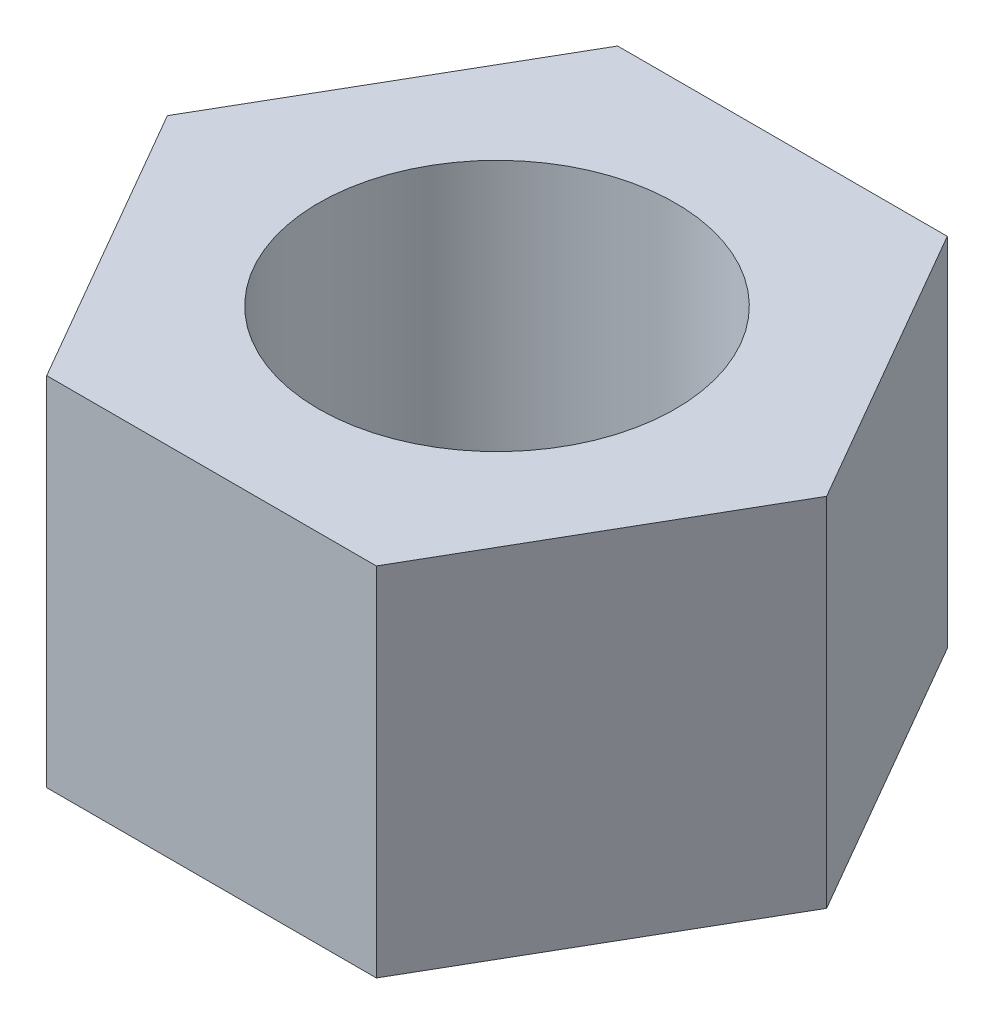
ISO-10303-21;
HEADER;
FILE_DESCRIPTION(('STEP AP214'),'2;1');
FILE_NAME('part.step','',(''),(''),'','','');
FILE_SCHEMA(('AUTOMOTIVE_DESIGN { 1 0 10303 214 1 1 1 1 }'));
ENDSEC;
DATA;
#1=APPLICATION_CONTEXT('core data for automotive mechanical design processes');
#2=APPLICATION_PROTOCOL_DEFINITION('international standard','automotive_design',2000,#1);
#3=PRODUCT_CONTEXT('',#1,'mechanical');
#4=PRODUCT('Part','Part','',(#3));
#5=PRODUCT_RELATED_PRODUCT_CATEGORY('part','',(#4));
#6=PRODUCT_DEFINITION_FORMATION('','',#4);
#7=PRODUCT_DEFINITION_CONTEXT('part definition',#1,'design');
#8=PRODUCT_DEFINITION('design','',#6,#7);
#9=PRODUCT_DEFINITION_SHAPE('','',#8);
#10=(LENGTH_UNIT() NAMED_UNIT(*) SI_UNIT(.MILLI.,.METRE.));
#11=(NAMED_UNIT(*) PLANE_ANGLE_UNIT() SI_UNIT($,.RADIAN.));
#12=(NAMED_UNIT(*) SI_UNIT($,.STERADIAN.) SOLID_ANGLE_UNIT());
#13=UNCERTAINTY_MEASURE_WITH_UNIT(LENGTH_MEASURE(1.E-05),#10,'distance_accuracy_value','');
#14=(GEOMETRIC_REPRESENTATION_CONTEXT(3) GLOBAL_UNCERTAINTY_ASSIGNED_CONTEXT((#13)) GLOBAL_UNIT_ASSIGNED_CONTEXT((#10,
#11,#12)) REPRESENTATION_CONTEXT('',''));
#15=CARTESIAN_POINT('',(0.,0.,0.));
#16=DIRECTION('',(0.,0.,1.));
#17=DIRECTION('',(1.,0.,0.));
#18=AXIS2_PLACEMENT_3D('',#15,#16,#17);
#19=CARTESIAN_POINT('',(2.3094010767585,5.,3.99999999999999));
#20=DIRECTION('',(-0.866025403784439,0.,-0.5));
#21=DIRECTION('',(-0.5,0.,0.866025403784439));
#22=AXIS2_PLACEMENT_3D('',#19,#20,#21);
#23=PLANE('',#22);
#24=DIRECTION('',(0.5,0.,-0.866025403784439));
#25=VECTOR('',#24,1.);
#26=CARTESIAN_POINT('',(2.3094010767585,0.,3.99999999999999));
#27=LINE('',#26,#25);
#28=CARTESIAN_POINT('',(2.3094010767585,0.,3.99999999999999));
#29=VERTEX_POINT('',#28);
#30=CARTESIAN_POINT('',(4.618802153517,0.,0.));
#31=VERTEX_POINT('',#30);
#32=EDGE_CURVE('E118',#29,#31,#27,.T.);
#33=ORIENTED_EDGE('',*,*,#32,.T.);
#34=DIRECTION('',(0.,-1.,0.));
#35=VECTOR('',#34,1.);
#36=CARTESIAN_POINT('',(4.618802153517,5.,0.));
#37=LINE('',#36,#35);
#38=CARTESIAN_POINT('',(4.618802153517,5.,0.));
#39=VERTEX_POINT('',#38);
#40=EDGE_CURVE('E11',#39,#31,#37,.T.);
#41=ORIENTED_EDGE('',*,*,#40,.F.);
#42=DIRECTION('',(0.5,0.,-0.866025403784439));
#43=VECTOR('',#42,1.);
#44=CARTESIAN_POINT('',(2.3094010767585,5.,3.99999999999999));
#45=LINE('',#44,#43);
#46=CARTESIAN_POINT('',(2.3094010767585,5.,3.99999999999999));
#47=VERTEX_POINT('',#46);
#48=EDGE_CURVE('E129',#47,#39,#45,.T.);
#49=ORIENTED_EDGE('',*,*,#48,.F.);
#50=DIRECTION('',(0.,-1.,0.));
#51=VECTOR('',#50,1.);
#52=CARTESIAN_POINT('',(2.3094010767585,5.,3.99999999999999));
#53=LINE('',#52,#51);
#54=EDGE_CURVE('E114',#47,#29,#53,.T.);
#55=ORIENTED_EDGE('',*,*,#54,.T.);
#56=EDGE_LOOP('',(#33,#41,#49,#55));
#57=FACE_BOUND('',#56,.T.);
#58=ADVANCED_FACE('F34',(#57),#23,.F.);
#59=CARTESIAN_POINT('',(4.618802153517,5.,0.));
#60=DIRECTION('',(-0.866025403784438,0.,0.5));
#61=DIRECTION('',(0.500000000000001,0.,0.866025403784438));
#62=AXIS2_PLACEMENT_3D('',#59,#60,#61);
#63=PLANE('',#62);
#64=DIRECTION('',(-0.5,0.,-0.866025403784438));
#65=VECTOR('',#64,1.);
#66=CARTESIAN_POINT('',(4.618802153517,0.,0.));
#67=LINE('',#66,#65);
#68=CARTESIAN_POINT('',(2.30940107675849,0.,-4.));
#69=VERTEX_POINT('',#68);
#70=EDGE_CURVE('E121',#31,#69,#67,.T.);
#71=ORIENTED_EDGE('',*,*,#70,.T.);
#72=DIRECTION('',(0.,-1.,0.));
#73=VECTOR('',#72,1.);
#74=CARTESIAN_POINT('',(2.30940107675849,5.,-4.));
#75=LINE('',#74,#73);
#76=CARTESIAN_POINT('',(2.30940107675849,5.,-4.));
#77=VERTEX_POINT('',#76);
#78=EDGE_CURVE('E42',#77,#69,#75,.T.);
#79=ORIENTED_EDGE('',*,*,#78,.F.);
#80=DIRECTION('',(-0.5,0.,-0.866025403784438));
#81=VECTOR('',#80,1.);
#82=CARTESIAN_POINT('',(4.618802153517,5.,0.));
#83=LINE('',#82,#81);
#84=EDGE_CURVE('E87',#39,#77,#83,.T.);
#85=ORIENTED_EDGE('',*,*,#84,.F.);
#86=ORIENTED_EDGE('',*,*,#40,.T.);
#87=EDGE_LOOP('',(#71,#79,#85,#86));
#88=FACE_BOUND('',#87,.T.);
#89=ADVANCED_FACE('F154',(#88),#63,.F.);
#90=CARTESIAN_POINT('',(2.30940107675849,5.,-4.));
#91=DIRECTION('',(0.,0.,1.));
#92=DIRECTION('',(1.,0.,0.));
#93=AXIS2_PLACEMENT_3D('',#90,#91,#92);
#94=PLANE('',#93);
#95=DIRECTION('',(-1.,0.,0.));
#96=VECTOR('',#95,1.);
#97=CARTESIAN_POINT('',(2.30940107675849,0.,-4.));
#98=LINE('',#97,#96);
#99=CARTESIAN_POINT('',(-2.30940107675851,0.,-4.));
#100=VERTEX_POINT('',#99);
#101=EDGE_CURVE('E124',#69,#100,#98,.T.);
#102=ORIENTED_EDGE('',*,*,#101,.T.);
#103=DIRECTION('',(0.,-1.,0.));
#104=VECTOR('',#103,1.);
#105=CARTESIAN_POINT('',(-2.30940107675851,5.,-4.));
#106=LINE('',#105,#104);
#107=CARTESIAN_POINT('',(-2.30940107675851,5.,-4.));
#108=VERTEX_POINT('',#107);
#109=EDGE_CURVE('E109',#108,#100,#106,.T.);
#110=ORIENTED_EDGE('',*,*,#109,.F.);
#111=DIRECTION('',(-1.,0.,0.));
#112=VECTOR('',#111,1.);
#113=CARTESIAN_POINT('',(2.30940107675849,5.,-4.));
#114=LINE('',#113,#112);
#115=EDGE_CURVE('E100',#77,#108,#114,.T.);
#116=ORIENTED_EDGE('',*,*,#115,.F.);
#117=ORIENTED_EDGE('',*,*,#78,.T.);
#118=EDGE_LOOP('',(#102,#110,#116,#117));
#119=FACE_BOUND('',#118,.T.);
#120=ADVANCED_FACE('F135',(#119),#94,.F.);
#121=CARTESIAN_POINT('',(-2.30940107675851,5.,-4.));
#122=DIRECTION('',(0.866025403784439,0.,0.5));
#123=DIRECTION('',(0.5,0.,-0.866025403784439));
#124=AXIS2_PLACEMENT_3D('',#121,#122,#123);
#125=PLANE('',#124);
#126=DIRECTION('',(-0.5,0.,0.866025403784439));
#127=VECTOR('',#126,1.);
#128=CARTESIAN_POINT('',(-2.30940107675851,0.,-4.));
#129=LINE('',#128,#127);
#130=CARTESIAN_POINT('',(-4.61880215351701,0.,0.));
#131=VERTEX_POINT('',#130);
#132=EDGE_CURVE('E108',#100,#131,#129,.T.);
#133=ORIENTED_EDGE('',*,*,#132,.T.);
#134=DIRECTION('',(0.,-1.,0.));
#135=VECTOR('',#134,1.);
#136=CARTESIAN_POINT('',(-4.61880215351701,5.,0.));
#137=LINE('',#136,#135);
#138=CARTESIAN_POINT('',(-4.61880215351701,5.,0.));
#139=VERTEX_POINT('',#138);
#140=EDGE_CURVE('E105',#139,#131,#137,.T.);
#141=ORIENTED_EDGE('',*,*,#140,.F.);
#142=DIRECTION('',(-0.5,0.,0.866025403784439));
#143=VECTOR('',#142,1.);
#144=CARTESIAN_POINT('',(-2.30940107675851,5.,-4.));
#145=LINE('',#144,#143);
#146=EDGE_CURVE('E94',#108,#139,#145,.T.);
#147=ORIENTED_EDGE('',*,*,#146,.F.);
#148=ORIENTED_EDGE('',*,*,#109,.T.);
#149=EDGE_LOOP('',(#133,#141,#147,#148));
#150=FACE_BOUND('',#149,.T.);
#151=ADVANCED_FACE('F106',(#150),#125,.F.);
#152=CARTESIAN_POINT('',(-4.61880215351701,5.,0.));
#153=DIRECTION('',(0.866025403784438,0.,-0.5));
#154=DIRECTION('',(-0.5,0.,-0.866025403784439));
#155=AXIS2_PLACEMENT_3D('',#152,#153,#154);
#156=PLANE('',#155);
#157=DIRECTION('',(0.5,0.,0.866025403784439));
#158=VECTOR('',#157,1.);
#159=CARTESIAN_POINT('',(-4.61880215351701,0.,0.));
#160=LINE('',#159,#158);
#161=CARTESIAN_POINT('',(-2.30940107675851,0.,4.));
#162=VERTEX_POINT('',#161);
#163=EDGE_CURVE('E73',#131,#162,#160,.T.);
#164=ORIENTED_EDGE('',*,*,#163,.T.);
#165=DIRECTION('',(0.,-1.,0.));
#166=VECTOR('',#165,1.);
#167=CARTESIAN_POINT('',(-2.30940107675851,5.,4.));
#168=LINE('',#167,#166);
#169=CARTESIAN_POINT('',(-2.30940107675851,5.,4.));
#170=VERTEX_POINT('',#169);
#171=EDGE_CURVE('E110',#170,#162,#168,.T.);
#172=ORIENTED_EDGE('',*,*,#171,.F.);
#173=DIRECTION('',(0.5,0.,0.866025403784439));
#174=VECTOR('',#173,1.);
#175=CARTESIAN_POINT('',(-4.61880215351701,5.,0.));
#176=LINE('',#175,#174);
#177=EDGE_CURVE('E98',#139,#170,#176,.T.);
#178=ORIENTED_EDGE('',*,*,#177,.F.);
#179=ORIENTED_EDGE('',*,*,#140,.T.);
#180=EDGE_LOOP('',(#164,#172,#178,#179));
#181=FACE_BOUND('',#180,.T.);
#182=ADVANCED_FACE('F112',(#181),#156,.F.);
#183=CARTESIAN_POINT('',(-2.30940107675851,5.,4.));
#184=DIRECTION('',(0.,0.,-1.));
#185=DIRECTION('',(-1.,0.,0.));
#186=AXIS2_PLACEMENT_3D('',#183,#184,#185);
#187=PLANE('',#186);
#188=DIRECTION('',(1.,0.,0.));
#189=VECTOR('',#188,1.);
#190=CARTESIAN_POINT('',(-2.30940107675851,0.,4.));
#191=LINE('',#190,#189);
#192=EDGE_CURVE('E79',#162,#29,#191,.T.);
#193=ORIENTED_EDGE('',*,*,#192,.T.);
#194=ORIENTED_EDGE('',*,*,#54,.F.);
#195=DIRECTION('',(1.,0.,0.));
#196=VECTOR('',#195,1.);
#197=CARTESIAN_POINT('',(-2.30940107675851,5.,4.));
#198=LINE('',#197,#196);
#199=EDGE_CURVE('E50',#170,#47,#198,.T.);
#200=ORIENTED_EDGE('',*,*,#199,.F.);
#201=ORIENTED_EDGE('',*,*,#171,.T.);
#202=EDGE_LOOP('',(#193,#194,#200,#201));
#203=FACE_BOUND('',#202,.T.);
#204=ADVANCED_FACE('F142',(#203),#187,.F.);
#205=CARTESIAN_POINT('',(0.,5.,0.));
#206=DIRECTION('',(0.,1.,0.));
#207=DIRECTION('',(0.,0.,1.));
#208=AXIS2_PLACEMENT_3D('',#205,#206,#207);
#209=PLANE('',#208);
#210=CARTESIAN_POINT('',(0.,5.,0.));
#211=DIRECTION('',(0.,1.,0.));
#212=DIRECTION('',(0.,0.,1.));
#213=AXIS2_PLACEMENT_3D('',#210,#211,#212);
#214=CIRCLE('',#213,2.5);
#215=CARTESIAN_POINT('',(0.,5.,2.5));
#216=VERTEX_POINT('',#215);
#217=EDGE_CURVE('E211',#216,#216,#214,.T.);
#218=ORIENTED_EDGE('',*,*,#217,.F.);
#219=EDGE_LOOP('',(#218));
#220=FACE_BOUND('',#219,.T.);
#221=ORIENTED_EDGE('',*,*,#48,.T.);
#222=ORIENTED_EDGE('',*,*,#84,.T.);
#223=ORIENTED_EDGE('',*,*,#115,.T.);
#224=ORIENTED_EDGE('',*,*,#146,.T.);
#225=ORIENTED_EDGE('',*,*,#177,.T.);
#226=ORIENTED_EDGE('',*,*,#199,.T.);
#227=EDGE_LOOP('',(#221,#222,#223,#224,#225,#226));
#228=FACE_BOUND('',#227,.T.);
#229=ADVANCED_FACE('F96',(#220,#228),#209,.T.);
#230=CARTESIAN_POINT('',(0.,0.,0.));
#231=DIRECTION('',(0.,1.,0.));
#232=DIRECTION('',(0.,0.,1.));
#233=AXIS2_PLACEMENT_3D('',#230,#231,#232);
#234=PLANE('',#233);
#235=CARTESIAN_POINT('',(0.,0.,0.));
#236=DIRECTION('',(0.,1.,0.));
#237=DIRECTION('',(0.,0.,1.));
#238=AXIS2_PLACEMENT_3D('',#235,#236,#237);
#239=CIRCLE('',#238,2.5);
#240=CARTESIAN_POINT('',(0.,0.,2.5));
#241=VERTEX_POINT('',#240);
#242=EDGE_CURVE('E122',#241,#241,#239,.T.);
#243=ORIENTED_EDGE('',*,*,#242,.T.);
#244=EDGE_LOOP('',(#243));
#245=FACE_BOUND('',#244,.T.);
#246=ORIENTED_EDGE('',*,*,#32,.F.);
#247=ORIENTED_EDGE('',*,*,#192,.F.);
#248=ORIENTED_EDGE('',*,*,#163,.F.);
#249=ORIENTED_EDGE('',*,*,#132,.F.);
#250=ORIENTED_EDGE('',*,*,#101,.F.);
#251=ORIENTED_EDGE('',*,*,#70,.F.);
#252=EDGE_LOOP('',(#246,#247,#248,#249,#250,#251));
#253=FACE_BOUND('',#252,.T.);
#254=ADVANCED_FACE('F138',(#245,#253),#234,.F.);
#255=CARTESIAN_POINT('',(0.,0.,0.));
#256=DIRECTION('',(0.,1.,0.));
#257=DIRECTION('',(0.,0.,1.));
#258=AXIS2_PLACEMENT_3D('',#255,#256,#257);
#259=CYLINDRICAL_SURFACE('',#258,2.5);
#260=ORIENTED_EDGE('',*,*,#242,.F.);
#261=EDGE_LOOP('',(#260));
#262=FACE_BOUND('',#261,.T.);
#263=ORIENTED_EDGE('',*,*,#217,.T.);
#264=EDGE_LOOP('',(#263));
#265=FACE_BOUND('',#264,.T.);
#266=ADVANCED_FACE('F191',(#262,#265),#259,.F.);
#267=CLOSED_SHELL('',(#58,#89,#120,#151,#182,#204,#229,#254,#266));
#268=MANIFOLD_SOLID_BREP('B2',#267);
#269=ADVANCED_BREP_SHAPE_REPRESENTATION('',(#18,#268),#14);
#270=SHAPE_DEFINITION_REPRESENTATION(#9,#269);
ENDSEC;
END-ISO-10303-21;
